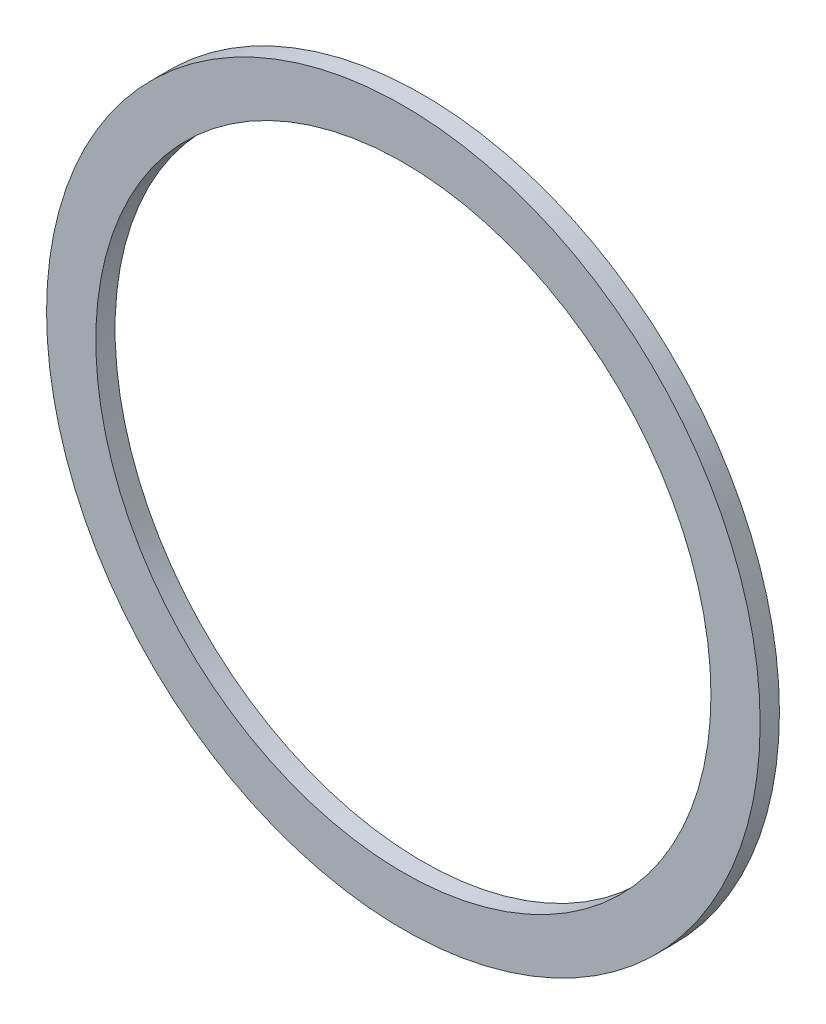
ISO-10303-21;
HEADER;
FILE_DESCRIPTION(('STEP AP214'),'2;1');
FILE_NAME('part.step','',(''),(''),'','','');
FILE_SCHEMA(('AUTOMOTIVE_DESIGN { 1 0 10303 214 1 1 1 1 }'));
ENDSEC;
DATA;
#1=APPLICATION_CONTEXT('core data for automotive mechanical design processes');
#2=APPLICATION_PROTOCOL_DEFINITION('international standard','automotive_design',2000,#1);
#3=PRODUCT_CONTEXT('',#1,'mechanical');
#4=PRODUCT('Part','Part','',(#3));
#5=PRODUCT_RELATED_PRODUCT_CATEGORY('part','',(#4));
#6=PRODUCT_DEFINITION_FORMATION('','',#4);
#7=PRODUCT_DEFINITION_CONTEXT('part definition',#1,'design');
#8=PRODUCT_DEFINITION('design','',#6,#7);
#9=PRODUCT_DEFINITION_SHAPE('','',#8);
#10=(LENGTH_UNIT() NAMED_UNIT(*) SI_UNIT(.MILLI.,.METRE.));
#11=(NAMED_UNIT(*) PLANE_ANGLE_UNIT() SI_UNIT($,.RADIAN.));
#12=(NAMED_UNIT(*) SI_UNIT($,.STERADIAN.) SOLID_ANGLE_UNIT());
#13=UNCERTAINTY_MEASURE_WITH_UNIT(LENGTH_MEASURE(1.E-05),#10,'distance_accuracy_value','');
#14=(GEOMETRIC_REPRESENTATION_CONTEXT(3) GLOBAL_UNCERTAINTY_ASSIGNED_CONTEXT((#13)) GLOBAL_UNIT_ASSIGNED_CONTEXT((#10,
#11,#12)) REPRESENTATION_CONTEXT('',''));
#15=CARTESIAN_POINT('',(0.,0.,0.));
#16=DIRECTION('',(0.,0.,1.));
#17=DIRECTION('',(1.,0.,0.));
#18=AXIS2_PLACEMENT_3D('',#15,#16,#17);
#19=CARTESIAN_POINT('',(0.,0.,4.7));
#20=DIRECTION('',(0.,0.,1.));
#21=DIRECTION('',(1.,0.,0.));
#22=AXIS2_PLACEMENT_3D('',#19,#20,#21);
#23=PLANE('',#22);
#24=CARTESIAN_POINT('',(0.,0.,4.7));
#25=DIRECTION('',(0.,0.,1.));
#26=DIRECTION('',(1.,0.,0.));
#27=AXIS2_PLACEMENT_3D('',#24,#25,#26);
#28=CIRCLE('',#27,87.);
#29=CARTESIAN_POINT('',(87.,0.,4.7));
#30=VERTEX_POINT('',#29);
#31=EDGE_CURVE('E10',#30,#30,#28,.T.);
#32=ORIENTED_EDGE('',*,*,#31,.T.);
#33=EDGE_LOOP('',(#32));
#34=FACE_BOUND('',#33,.T.);
#35=CARTESIAN_POINT('',(0.,0.,4.7));
#36=DIRECTION('',(0.,0.,1.));
#37=DIRECTION('',(1.,0.,0.));
#38=AXIS2_PLACEMENT_3D('',#35,#36,#37);
#39=CIRCLE('',#38,75.);
#40=CARTESIAN_POINT('',(75.,0.,4.7));
#41=VERTEX_POINT('',#40);
#42=EDGE_CURVE('E43',#41,#41,#39,.T.);
#43=ORIENTED_EDGE('',*,*,#42,.F.);
#44=EDGE_LOOP('',(#43));
#45=FACE_BOUND('',#44,.T.);
#46=ADVANCED_FACE('F32',(#34,#45),#23,.T.);
#47=CARTESIAN_POINT('',(0.,0.,0.));
#48=DIRECTION('',(0.,0.,1.));
#49=DIRECTION('',(1.,0.,0.));
#50=AXIS2_PLACEMENT_3D('',#47,#48,#49);
#51=PLANE('',#50);
#52=CARTESIAN_POINT('',(0.,0.,0.));
#53=DIRECTION('',(0.,0.,1.));
#54=DIRECTION('',(1.,0.,0.));
#55=AXIS2_PLACEMENT_3D('',#52,#53,#54);
#56=CIRCLE('',#55,87.);
#57=CARTESIAN_POINT('',(87.,0.,0.));
#58=VERTEX_POINT('',#57);
#59=EDGE_CURVE('E36',#58,#58,#56,.T.);
#60=ORIENTED_EDGE('',*,*,#59,.F.);
#61=EDGE_LOOP('',(#60));
#62=FACE_BOUND('',#61,.T.);
#63=CARTESIAN_POINT('',(0.,0.,0.));
#64=DIRECTION('',(0.,0.,1.));
#65=DIRECTION('',(1.,0.,0.));
#66=AXIS2_PLACEMENT_3D('',#63,#64,#65);
#67=CIRCLE('',#66,75.);
#68=CARTESIAN_POINT('',(75.,0.,0.));
#69=VERTEX_POINT('',#68);
#70=EDGE_CURVE('E45',#69,#69,#67,.T.);
#71=ORIENTED_EDGE('',*,*,#70,.T.);
#72=EDGE_LOOP('',(#71));
#73=FACE_BOUND('',#72,.T.);
#74=ADVANCED_FACE('F55',(#62,#73),#51,.F.);
#75=CARTESIAN_POINT('',(0.,0.,4.7));
#76=DIRECTION('',(0.,0.,-1.));
#77=DIRECTION('',(-1.,0.,0.));
#78=AXIS2_PLACEMENT_3D('',#75,#76,#77);
#79=CYLINDRICAL_SURFACE('',#78,87.);
#80=ORIENTED_EDGE('',*,*,#31,.F.);
#81=EDGE_LOOP('',(#80));
#82=FACE_BOUND('',#81,.T.);
#83=ORIENTED_EDGE('',*,*,#59,.T.);
#84=EDGE_LOOP('',(#83));
#85=FACE_BOUND('',#84,.T.);
#86=ADVANCED_FACE('F34',(#82,#85),#79,.T.);
#87=CARTESIAN_POINT('',(0.,0.,4.7));
#88=DIRECTION('',(0.,0.,-1.));
#89=DIRECTION('',(-1.,0.,0.));
#90=AXIS2_PLACEMENT_3D('',#87,#88,#89);
#91=CYLINDRICAL_SURFACE('',#90,75.);
#92=ORIENTED_EDGE('',*,*,#42,.T.);
#93=EDGE_LOOP('',(#92));
#94=FACE_BOUND('',#93,.T.);
#95=ORIENTED_EDGE('',*,*,#70,.F.);
#96=EDGE_LOOP('',(#95));
#97=FACE_BOUND('',#96,.T.);
#98=ADVANCED_FACE('F51',(#94,#97),#91,.F.);
#99=CLOSED_SHELL('',(#46,#74,#86,#98));
#100=MANIFOLD_SOLID_BREP('B2',#99);
#101=ADVANCED_BREP_SHAPE_REPRESENTATION('',(#18,#100),#14);
#102=SHAPE_DEFINITION_REPRESENTATION(#9,#101);
ENDSEC;
END-ISO-10303-21;
